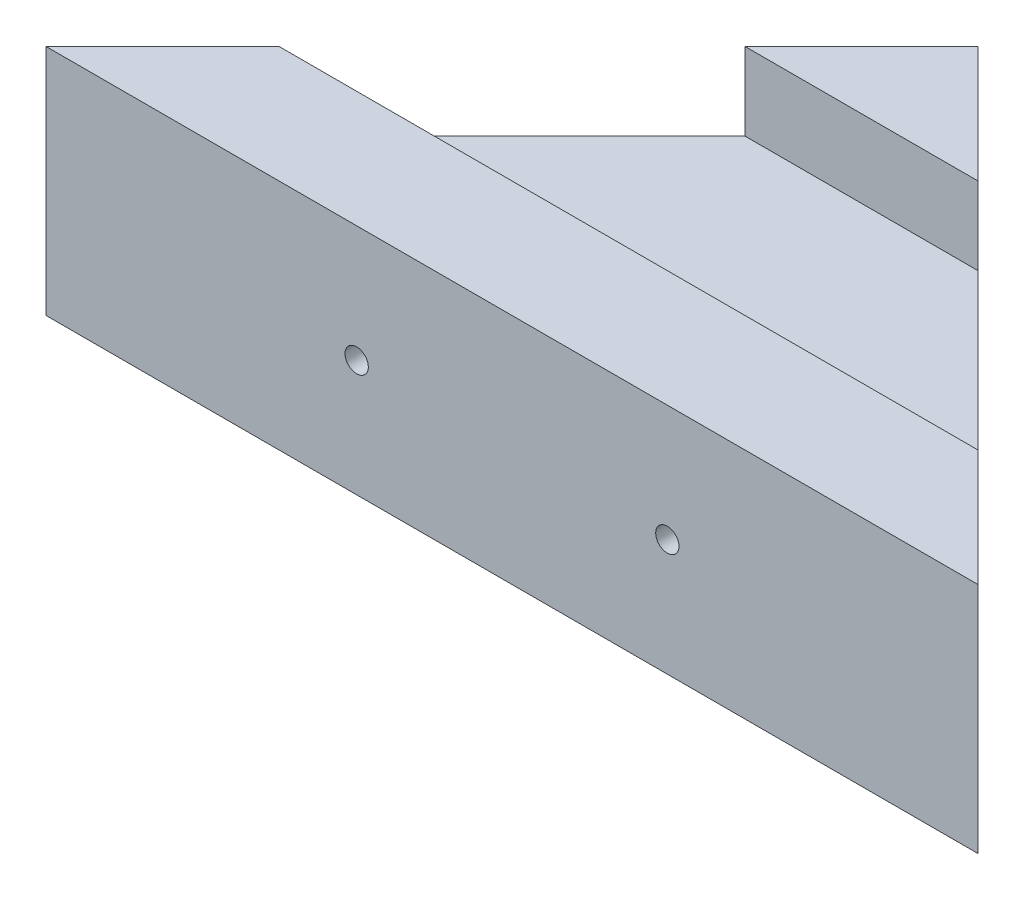
ISO-10303-21;
HEADER;
FILE_DESCRIPTION(('STEP AP214'),'2;1');
FILE_NAME('part.step','',(''),(''),'','','');
FILE_SCHEMA(('AUTOMOTIVE_DESIGN { 1 0 10303 214 1 1 1 1 }'));
ENDSEC;
DATA;
#1=APPLICATION_CONTEXT('core data for automotive mechanical design processes');
#2=APPLICATION_PROTOCOL_DEFINITION('international standard','automotive_design',2000,#1);
#3=PRODUCT_CONTEXT('',#1,'mechanical');
#4=PRODUCT('Part','Part','',(#3));
#5=PRODUCT_RELATED_PRODUCT_CATEGORY('part','',(#4));
#6=PRODUCT_DEFINITION_FORMATION('','',#4);
#7=PRODUCT_DEFINITION_CONTEXT('part definition',#1,'design');
#8=PRODUCT_DEFINITION('design','',#6,#7);
#9=PRODUCT_DEFINITION_SHAPE('','',#8);
#10=(LENGTH_UNIT() NAMED_UNIT(*) SI_UNIT(.MILLI.,.METRE.));
#11=(NAMED_UNIT(*) PLANE_ANGLE_UNIT() SI_UNIT($,.RADIAN.));
#12=(NAMED_UNIT(*) SI_UNIT($,.STERADIAN.) SOLID_ANGLE_UNIT());
#13=UNCERTAINTY_MEASURE_WITH_UNIT(LENGTH_MEASURE(1.E-05),#10,'distance_accuracy_value','');
#14=(GEOMETRIC_REPRESENTATION_CONTEXT(3) GLOBAL_UNCERTAINTY_ASSIGNED_CONTEXT((#13)) GLOBAL_UNIT_ASSIGNED_CONTEXT((#10,
#11,#12)) REPRESENTATION_CONTEXT('',''));
#15=CARTESIAN_POINT('',(0.,0.,0.));
#16=DIRECTION('',(0.,0.,1.));
#17=DIRECTION('',(1.,0.,0.));
#18=AXIS2_PLACEMENT_3D('',#15,#16,#17);
#19=CARTESIAN_POINT('',(0.,15.,0.));
#20=DIRECTION('',(0.,-1.,0.));
#21=DIRECTION('',(0.,0.,-1.));
#22=AXIS2_PLACEMENT_3D('',#19,#20,#21);
#23=PLANE('',#22);
#24=DIRECTION('',(-0.707106781186547,0.,0.707106781186547));
#25=VECTOR('',#24,1.);
#26=CARTESIAN_POINT('',(30.,15.,-30.));
#27=LINE('',#26,#25);
#28=CARTESIAN_POINT('',(30.,15.,-30.));
#29=VERTEX_POINT('',#28);
#30=CARTESIAN_POINT('',(22.5,15.,-22.5));
#31=VERTEX_POINT('',#30);
#32=EDGE_CURVE('E134',#29,#31,#27,.T.);
#33=ORIENTED_EDGE('',*,*,#32,.T.);
#34=DIRECTION('',(-1.,0.,0.));
#35=VECTOR('',#34,1.);
#36=CARTESIAN_POINT('',(22.5,15.,-22.5));
#37=LINE('',#36,#35);
#38=CARTESIAN_POINT('',(37.5,15.,-22.5));
#39=VERTEX_POINT('',#38);
#40=EDGE_CURVE('E125',#39,#31,#37,.T.);
#41=ORIENTED_EDGE('',*,*,#40,.F.);
#42=DIRECTION('',(-0.707106781186547,0.,-0.707106781186547));
#43=VECTOR('',#42,1.);
#44=CARTESIAN_POINT('',(60.,15.,0.));
#45=LINE('',#44,#43);
#46=EDGE_CURVE('E64',#39,#29,#45,.T.);
#47=ORIENTED_EDGE('',*,*,#46,.T.);
#48=EDGE_LOOP('',(#33,#41,#47));
#49=FACE_BOUND('',#48,.T.);
#50=ADVANCED_FACE('F39',(#49),#23,.F.);
#51=CARTESIAN_POINT('',(30.,15.,-30.));
#52=DIRECTION('',(0.707106781186547,0.,0.707106781186547));
#53=DIRECTION('',(0.707106781186548,0.,-0.707106781186548));
#54=AXIS2_PLACEMENT_3D('',#51,#52,#53);
#55=PLANE('',#54);
#56=CARTESIAN_POINT('',(20.,7.5,-20.));
#57=DIRECTION('',(0.707106781186547,0.,0.707106781186547));
#58=DIRECTION('',(-0.707106781186548,0.,0.707106781186548));
#59=AXIS2_PLACEMENT_3D('',#56,#57,#58);
#60=ELLIPSE('',#59,1.06066017177982,0.750000000000002);
#61=CARTESIAN_POINT('',(19.25,7.5,-19.25));
#62=VERTEX_POINT('',#61);
#63=EDGE_CURVE('E164',#62,#62,#60,.T.);
#64=ORIENTED_EDGE('',*,*,#63,.T.);
#65=EDGE_LOOP('',(#64));
#66=FACE_BOUND('',#65,.T.);
#67=DIRECTION('',(-0.707106781186547,0.,0.707106781186547));
#68=VECTOR('',#67,1.);
#69=CARTESIAN_POINT('',(22.5,10.,-22.5));
#70=LINE('',#69,#68);
#71=CARTESIAN_POINT('',(22.5,10.,-22.5));
#72=VERTEX_POINT('',#71);
#73=CARTESIAN_POINT('',(7.5,10.,-7.5));
#74=VERTEX_POINT('',#73);
#75=EDGE_CURVE('E116',#72,#74,#70,.T.);
#76=ORIENTED_EDGE('',*,*,#75,.F.);
#77=DIRECTION('',(0.,1.,0.));
#78=VECTOR('',#77,1.);
#79=CARTESIAN_POINT('',(22.5,10.,-22.5));
#80=LINE('',#79,#78);
#81=EDGE_CURVE('E146',#72,#31,#80,.T.);
#82=ORIENTED_EDGE('',*,*,#81,.T.);
#83=ORIENTED_EDGE('',*,*,#32,.F.);
#84=DIRECTION('',(0.,-1.,0.));
#85=VECTOR('',#84,1.);
#86=CARTESIAN_POINT('',(30.,15.,-30.));
#87=LINE('',#86,#85);
#88=CARTESIAN_POINT('',(30.,0.,-30.));
#89=VERTEX_POINT('',#88);
#90=EDGE_CURVE('E141',#29,#89,#87,.T.);
#91=ORIENTED_EDGE('',*,*,#90,.T.);
#92=DIRECTION('',(-0.707106781186547,0.,0.707106781186547));
#93=VECTOR('',#92,1.);
#94=CARTESIAN_POINT('',(30.,0.,-30.));
#95=LINE('',#94,#93);
#96=CARTESIAN_POINT('',(0.,0.,0.));
#97=VERTEX_POINT('',#96);
#98=EDGE_CURVE('E142',#89,#97,#95,.T.);
#99=ORIENTED_EDGE('',*,*,#98,.T.);
#100=DIRECTION('',(0.,-1.,0.));
#101=VECTOR('',#100,1.);
#102=CARTESIAN_POINT('',(0.,15.,0.));
#103=LINE('',#102,#101);
#104=CARTESIAN_POINT('',(0.,15.,0.));
#105=VERTEX_POINT('',#104);
#106=EDGE_CURVE('E11',#105,#97,#103,.T.);
#107=ORIENTED_EDGE('',*,*,#106,.F.);
#108=CARTESIAN_POINT('',(7.50000000000001,15.,-7.50000000000001));
#109=VERTEX_POINT('',#108);
#110=EDGE_CURVE('E87',#109,#105,#27,.T.);
#111=ORIENTED_EDGE('',*,*,#110,.F.);
#112=DIRECTION('',(0.,1.,0.));
#113=VECTOR('',#112,1.);
#114=CARTESIAN_POINT('',(7.5,10.,-7.5));
#115=LINE('',#114,#113);
#116=EDGE_CURVE('E55',#74,#109,#115,.T.);
#117=ORIENTED_EDGE('',*,*,#116,.F.);
#118=EDGE_LOOP('',(#76,#82,#83,#91,#99,#107,#111,#117));
#119=FACE_BOUND('',#118,.T.);
#120=ADVANCED_FACE('F41',(#66,#119),#55,.F.);
#121=CARTESIAN_POINT('',(0.,15.,0.));
#122=DIRECTION('',(0.,0.,-1.));
#123=DIRECTION('',(-1.,0.,0.));
#124=AXIS2_PLACEMENT_3D('',#121,#122,#123);
#125=PLANE('',#124);
#126=CARTESIAN_POINT('',(20.,7.5,0.));
#127=DIRECTION('',(0.,0.,1.));
#128=DIRECTION('',(1.,0.,0.));
#129=AXIS2_PLACEMENT_3D('',#126,#127,#128);
#130=CIRCLE('',#129,0.750000000000002);
#131=CARTESIAN_POINT('',(20.75,7.5,0.));
#132=VERTEX_POINT('',#131);
#133=EDGE_CURVE('E172',#132,#132,#130,.T.);
#134=ORIENTED_EDGE('',*,*,#133,.F.);
#135=EDGE_LOOP('',(#134));
#136=FACE_BOUND('',#135,.T.);
#137=CARTESIAN_POINT('',(40.,7.5,0.));
#138=DIRECTION('',(0.,0.,1.));
#139=DIRECTION('',(1.,0.,0.));
#140=AXIS2_PLACEMENT_3D('',#137,#138,#139);
#141=CIRCLE('',#140,0.749999999999999);
#142=CARTESIAN_POINT('',(40.75,7.5,0.));
#143=VERTEX_POINT('',#142);
#144=EDGE_CURVE('E169',#143,#143,#141,.T.);
#145=ORIENTED_EDGE('',*,*,#144,.F.);
#146=EDGE_LOOP('',(#145));
#147=FACE_BOUND('',#146,.T.);
#148=DIRECTION('',(1.,0.,0.));
#149=VECTOR('',#148,1.);
#150=CARTESIAN_POINT('',(0.,0.,0.));
#151=LINE('',#150,#149);
#152=CARTESIAN_POINT('',(60.,0.,0.));
#153=VERTEX_POINT('',#152);
#154=EDGE_CURVE('E145',#97,#153,#151,.T.);
#155=ORIENTED_EDGE('',*,*,#154,.T.);
#156=DIRECTION('',(0.,-1.,0.));
#157=VECTOR('',#156,1.);
#158=CARTESIAN_POINT('',(60.,15.,0.));
#159=LINE('',#158,#157);
#160=CARTESIAN_POINT('',(60.,15.,0.));
#161=VERTEX_POINT('',#160);
#162=EDGE_CURVE('E48',#161,#153,#159,.T.);
#163=ORIENTED_EDGE('',*,*,#162,.F.);
#164=DIRECTION('',(1.,0.,0.));
#165=VECTOR('',#164,1.);
#166=CARTESIAN_POINT('',(0.,15.,0.));
#167=LINE('',#166,#165);
#168=EDGE_CURVE('E136',#105,#161,#167,.T.);
#169=ORIENTED_EDGE('',*,*,#168,.F.);
#170=ORIENTED_EDGE('',*,*,#106,.T.);
#171=EDGE_LOOP('',(#155,#163,#169,#170));
#172=FACE_BOUND('',#171,.T.);
#173=ADVANCED_FACE('F200',(#136,#147,#172),#125,.F.);
#174=CARTESIAN_POINT('',(60.,15.,0.));
#175=DIRECTION('',(-0.707106781186547,0.,0.707106781186547));
#176=DIRECTION('',(0.707106781186548,0.,0.707106781186548));
#177=AXIS2_PLACEMENT_3D('',#174,#175,#176);
#178=PLANE('',#177);
#179=CARTESIAN_POINT('',(40.,7.5,-20.));
#180=DIRECTION('',(-0.707106781186547,0.,0.707106781186547));
#181=DIRECTION('',(0.707106781186548,0.,0.707106781186548));
#182=AXIS2_PLACEMENT_3D('',#179,#180,#181);
#183=ELLIPSE('',#182,1.06066017177982,0.749999999999999);
#184=CARTESIAN_POINT('',(40.75,7.5,-19.25));
#185=VERTEX_POINT('',#184);
#186=EDGE_CURVE('E43',#185,#185,#183,.T.);
#187=ORIENTED_EDGE('',*,*,#186,.T.);
#188=EDGE_LOOP('',(#187));
#189=FACE_BOUND('',#188,.T.);
#190=ORIENTED_EDGE('',*,*,#46,.F.);
#191=DIRECTION('',(0.,1.,0.));
#192=VECTOR('',#191,1.);
#193=CARTESIAN_POINT('',(37.5,10.,-22.5));
#194=LINE('',#193,#192);
#195=CARTESIAN_POINT('',(37.5,10.,-22.5));
#196=VERTEX_POINT('',#195);
#197=EDGE_CURVE('E129',#196,#39,#194,.T.);
#198=ORIENTED_EDGE('',*,*,#197,.F.);
#199=DIRECTION('',(-0.707106781186547,0.,-0.707106781186548));
#200=VECTOR('',#199,1.);
#201=CARTESIAN_POINT('',(37.5,10.,-22.5));
#202=LINE('',#201,#200);
#203=CARTESIAN_POINT('',(52.5,10.,-7.5));
#204=VERTEX_POINT('',#203);
#205=EDGE_CURVE('E115',#204,#196,#202,.T.);
#206=ORIENTED_EDGE('',*,*,#205,.F.);
#207=DIRECTION('',(0.,1.,0.));
#208=VECTOR('',#207,1.);
#209=CARTESIAN_POINT('',(52.5,10.,-7.5));
#210=LINE('',#209,#208);
#211=CARTESIAN_POINT('',(52.5,15.,-7.5));
#212=VERTEX_POINT('',#211);
#213=EDGE_CURVE('E112',#204,#212,#210,.T.);
#214=ORIENTED_EDGE('',*,*,#213,.T.);
#215=EDGE_CURVE('E138',#161,#212,#45,.T.);
#216=ORIENTED_EDGE('',*,*,#215,.F.);
#217=ORIENTED_EDGE('',*,*,#162,.T.);
#218=DIRECTION('',(-0.707106781186547,0.,-0.707106781186547));
#219=VECTOR('',#218,1.);
#220=CARTESIAN_POINT('',(60.,0.,0.));
#221=LINE('',#220,#219);
#222=EDGE_CURVE('E82',#153,#89,#221,.T.);
#223=ORIENTED_EDGE('',*,*,#222,.T.);
#224=ORIENTED_EDGE('',*,*,#90,.F.);
#225=EDGE_LOOP('',(#190,#198,#206,#214,#216,#217,#223,#224));
#226=FACE_BOUND('',#225,.T.);
#227=ADVANCED_FACE('F152',(#189,#226),#178,.F.);
#228=ORIENTED_EDGE('',*,*,#215,.T.);
#229=DIRECTION('',(1.,0.,0.));
#230=VECTOR('',#229,1.);
#231=CARTESIAN_POINT('',(7.5,15.,-7.5));
#232=LINE('',#231,#230);
#233=EDGE_CURVE('E163',#109,#212,#232,.T.);
#234=ORIENTED_EDGE('',*,*,#233,.F.);
#235=ORIENTED_EDGE('',*,*,#110,.T.);
#236=ORIENTED_EDGE('',*,*,#168,.T.);
#237=EDGE_LOOP('',(#228,#234,#235,#236));
#238=FACE_BOUND('',#237,.T.);
#239=ADVANCED_FACE('F194',(#238),#23,.F.);
#240=CARTESIAN_POINT('',(0.,0.,0.));
#241=DIRECTION('',(0.,-1.,0.));
#242=DIRECTION('',(0.,0.,-1.));
#243=AXIS2_PLACEMENT_3D('',#240,#241,#242);
#244=PLANE('',#243);
#245=ORIENTED_EDGE('',*,*,#98,.F.);
#246=ORIENTED_EDGE('',*,*,#222,.F.);
#247=ORIENTED_EDGE('',*,*,#154,.F.);
#248=EDGE_LOOP('',(#245,#246,#247));
#249=FACE_BOUND('',#248,.T.);
#250=ADVANCED_FACE('F156',(#249),#244,.T.);
#251=CARTESIAN_POINT('',(22.5,10.,-22.5));
#252=DIRECTION('',(0.,0.,-1.));
#253=DIRECTION('',(-1.,0.,0.));
#254=AXIS2_PLACEMENT_3D('',#251,#252,#253);
#255=PLANE('',#254);
#256=ORIENTED_EDGE('',*,*,#40,.T.);
#257=ORIENTED_EDGE('',*,*,#81,.F.);
#258=DIRECTION('',(-1.,0.,0.));
#259=VECTOR('',#258,1.);
#260=CARTESIAN_POINT('',(22.5,10.,-22.5));
#261=LINE('',#260,#259);
#262=EDGE_CURVE('E122',#196,#72,#261,.T.);
#263=ORIENTED_EDGE('',*,*,#262,.F.);
#264=ORIENTED_EDGE('',*,*,#197,.T.);
#265=EDGE_LOOP('',(#256,#257,#263,#264));
#266=FACE_BOUND('',#265,.T.);
#267=ADVANCED_FACE('F207',(#266),#255,.F.);
#268=CARTESIAN_POINT('',(7.5,10.,-7.5));
#269=DIRECTION('',(0.,0.,1.));
#270=DIRECTION('',(1.,0.,0.));
#271=AXIS2_PLACEMENT_3D('',#268,#269,#270);
#272=PLANE('',#271);
#273=ORIENTED_EDGE('',*,*,#233,.T.);
#274=ORIENTED_EDGE('',*,*,#213,.F.);
#275=DIRECTION('',(1.,0.,0.));
#276=VECTOR('',#275,1.);
#277=CARTESIAN_POINT('',(7.5,10.,-7.5));
#278=LINE('',#277,#276);
#279=EDGE_CURVE('E108',#74,#204,#278,.T.);
#280=ORIENTED_EDGE('',*,*,#279,.F.);
#281=ORIENTED_EDGE('',*,*,#116,.T.);
#282=EDGE_LOOP('',(#273,#274,#280,#281));
#283=FACE_BOUND('',#282,.T.);
#284=ADVANCED_FACE('F110',(#283),#272,.F.);
#285=CARTESIAN_POINT('',(0.,10.,0.));
#286=DIRECTION('',(0.,1.,0.));
#287=DIRECTION('',(0.,0.,1.));
#288=AXIS2_PLACEMENT_3D('',#285,#286,#287);
#289=PLANE('',#288);
#290=ORIENTED_EDGE('',*,*,#75,.T.);
#291=ORIENTED_EDGE('',*,*,#279,.T.);
#292=ORIENTED_EDGE('',*,*,#205,.T.);
#293=ORIENTED_EDGE('',*,*,#262,.T.);
#294=EDGE_LOOP('',(#290,#291,#292,#293));
#295=FACE_BOUND('',#294,.T.);
#296=ADVANCED_FACE('F120',(#295),#289,.T.);
#297=CARTESIAN_POINT('',(40.,7.5,-24.6213203435597));
#298=DIRECTION('',(0.,0.,1.));
#299=DIRECTION('',(1.,0.,0.));
#300=AXIS2_PLACEMENT_3D('',#297,#298,#299);
#301=CYLINDRICAL_SURFACE('',#300,0.749999999999999);
#302=ORIENTED_EDGE('',*,*,#144,.T.);
#303=EDGE_LOOP('',(#302));
#304=FACE_BOUND('',#303,.T.);
#305=ORIENTED_EDGE('',*,*,#186,.F.);
#306=EDGE_LOOP('',(#305));
#307=FACE_BOUND('',#306,.T.);
#308=ADVANCED_FACE('F180',(#304,#307),#301,.F.);
#309=CARTESIAN_POINT('',(20.,7.5,-24.6213203435597));
#310=DIRECTION('',(0.,0.,1.));
#311=DIRECTION('',(1.,0.,0.));
#312=AXIS2_PLACEMENT_3D('',#309,#310,#311);
#313=CYLINDRICAL_SURFACE('',#312,0.750000000000002);
#314=ORIENTED_EDGE('',*,*,#133,.T.);
#315=EDGE_LOOP('',(#314));
#316=FACE_BOUND('',#315,.T.);
#317=ORIENTED_EDGE('',*,*,#63,.F.);
#318=EDGE_LOOP('',(#317));
#319=FACE_BOUND('',#318,.T.);
#320=ADVANCED_FACE('F182',(#316,#319),#313,.F.);
#321=CLOSED_SHELL('',(#50,#120,#173,#227,#239,#250,#267,#284,#296,#308,#320));
#322=MANIFOLD_SOLID_BREP('B2',#321);
#323=ADVANCED_BREP_SHAPE_REPRESENTATION('',(#18,#322),#14);
#324=SHAPE_DEFINITION_REPRESENTATION(#9,#323);
ENDSEC;
END-ISO-10303-21;
